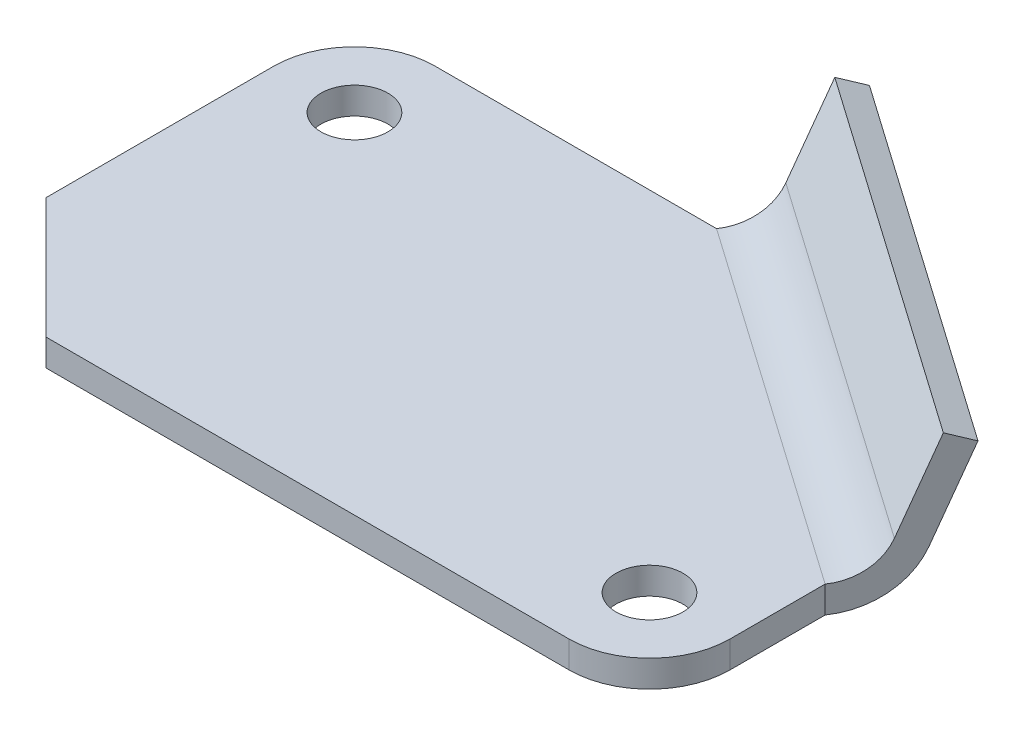
ISO-10303-21;
HEADER;
FILE_DESCRIPTION(('STEP AP214'),'2;1');
FILE_NAME('part.step','',(''),(''),'','','');
FILE_SCHEMA(('AUTOMOTIVE_DESIGN { 1 0 10303 214 1 1 1 1 }'));
ENDSEC;
DATA;
#1=APPLICATION_CONTEXT('core data for automotive mechanical design processes');
#2=APPLICATION_PROTOCOL_DEFINITION('international standard','automotive_design',2000,#1);
#3=PRODUCT_CONTEXT('',#1,'mechanical');
#4=PRODUCT('Part','Part','',(#3));
#5=PRODUCT_RELATED_PRODUCT_CATEGORY('part','',(#4));
#6=PRODUCT_DEFINITION_FORMATION('','',#4);
#7=PRODUCT_DEFINITION_CONTEXT('part definition',#1,'design');
#8=PRODUCT_DEFINITION('design','',#6,#7);
#9=PRODUCT_DEFINITION_SHAPE('','',#8);
#10=(LENGTH_UNIT() NAMED_UNIT(*) SI_UNIT(.MILLI.,.METRE.));
#11=(NAMED_UNIT(*) PLANE_ANGLE_UNIT() SI_UNIT($,.RADIAN.));
#12=(NAMED_UNIT(*) SI_UNIT($,.STERADIAN.) SOLID_ANGLE_UNIT());
#13=UNCERTAINTY_MEASURE_WITH_UNIT(LENGTH_MEASURE(1.E-05),#10,'distance_accuracy_value','');
#14=(GEOMETRIC_REPRESENTATION_CONTEXT(3) GLOBAL_UNCERTAINTY_ASSIGNED_CONTEXT((#13)) GLOBAL_UNIT_ASSIGNED_CONTEXT((#10,
#11,#12)) REPRESENTATION_CONTEXT('',''));
#15=CARTESIAN_POINT('',(0.,0.,0.));
#16=DIRECTION('',(0.,0.,1.));
#17=DIRECTION('',(1.,0.,0.));
#18=AXIS2_PLACEMENT_3D('',#15,#16,#17);
#19=CARTESIAN_POINT('',(-42.,4.,-20.));
#20=DIRECTION('',(0.,-1.,0.));
#21=DIRECTION('',(0.,0.,-1.));
#22=AXIS2_PLACEMENT_3D('',#19,#20,#21);
#23=PLANE('',#22);
#24=CARTESIAN_POINT('',(-42.,4.,-20.));
#25=DIRECTION('',(0.,1.,0.));
#26=DIRECTION('',(0.,0.,-1.));
#27=AXIS2_PLACEMENT_3D('',#24,#25,#26);
#28=CIRCLE('',#27,12.);
#29=CARTESIAN_POINT('',(-41.9999999999999,4.,-32.));
#30=VERTEX_POINT('',#29);
#31=CARTESIAN_POINT('',(-54.,4.,-19.9999999999999));
#32=VERTEX_POINT('',#31);
#33=EDGE_CURVE('E180',#30,#32,#28,.T.);
#34=ORIENTED_EDGE('',*,*,#33,.T.);
#35=DIRECTION('',(0.,0.,1.));
#36=VECTOR('',#35,1.);
#37=CARTESIAN_POINT('',(-54.,4.,14.));
#38=LINE('',#37,#36);
#39=CARTESIAN_POINT('',(-54.,4.,14.));
#40=VERTEX_POINT('',#39);
#41=EDGE_CURVE('E104',#32,#40,#38,.T.);
#42=ORIENTED_EDGE('',*,*,#41,.T.);
#43=DIRECTION('',(0.707106781186547,0.,0.707106781186548));
#44=VECTOR('',#43,1.);
#45=CARTESIAN_POINT('',(-54.,4.,14.));
#46=LINE('',#45,#44);
#47=CARTESIAN_POINT('',(-36.,4.,32.));
#48=VERTEX_POINT('',#47);
#49=EDGE_CURVE('E122',#40,#48,#46,.T.);
#50=ORIENTED_EDGE('',*,*,#49,.T.);
#51=DIRECTION('',(1.,0.,0.));
#52=VECTOR('',#51,1.);
#53=CARTESIAN_POINT('',(-36.,4.,32.));
#54=LINE('',#53,#52);
#55=CARTESIAN_POINT('',(41.9999999999999,4.,32.));
#56=VERTEX_POINT('',#55);
#57=EDGE_CURVE('E114',#48,#56,#54,.T.);
#58=ORIENTED_EDGE('',*,*,#57,.T.);
#59=CARTESIAN_POINT('',(42.,4.,20.));
#60=DIRECTION('',(0.,1.,0.));
#61=DIRECTION('',(0.,0.,1.));
#62=AXIS2_PLACEMENT_3D('',#59,#60,#61);
#63=CIRCLE('',#62,12.);
#64=CARTESIAN_POINT('',(54.,4.,19.9999999999999));
#65=VERTEX_POINT('',#64);
#66=EDGE_CURVE('E119',#56,#65,#63,.T.);
#67=ORIENTED_EDGE('',*,*,#66,.T.);
#68=DIRECTION('',(0.,0.,-1.));
#69=VECTOR('',#68,1.);
#70=CARTESIAN_POINT('',(54.,4.,19.9999999999999));
#71=LINE('',#70,#69);
#72=CARTESIAN_POINT('',(54.,4.,5.81120706332443));
#73=VERTEX_POINT('',#72);
#74=EDGE_CURVE('E143',#65,#73,#71,.T.);
#75=ORIENTED_EDGE('',*,*,#74,.T.);
#76=DIRECTION('',(-0.819152044288991,0.,-0.573576436351047));
#77=VECTOR('',#76,1.);
#78=CARTESIAN_POINT('',(0.,4.,-32.));
#79=LINE('',#78,#77);
#80=CARTESIAN_POINT('',(0.,4.,-32.));
#81=VERTEX_POINT('',#80);
#82=EDGE_CURVE('E146',#73,#81,#79,.T.);
#83=ORIENTED_EDGE('',*,*,#82,.T.);
#84=DIRECTION('',(-1.,0.,0.));
#85=VECTOR('',#84,1.);
#86=CARTESIAN_POINT('',(-41.9999999999999,4.,-32.));
#87=LINE('',#86,#85);
#88=EDGE_CURVE('E61',#81,#30,#87,.T.);
#89=ORIENTED_EDGE('',*,*,#88,.T.);
#90=EDGE_LOOP('',(#34,#42,#50,#58,#67,#75,#83,#89));
#91=FACE_BOUND('',#90,.T.);
#92=CARTESIAN_POINT('',(42.,4.,20.));
#93=DIRECTION('',(0.,1.,0.));
#94=DIRECTION('',(0.,0.,1.));
#95=AXIS2_PLACEMENT_3D('',#92,#93,#94);
#96=CIRCLE('',#95,5.);
#97=CARTESIAN_POINT('',(42.,4.,25.));
#98=VERTEX_POINT('',#97);
#99=EDGE_CURVE('E160',#98,#98,#96,.T.);
#100=ORIENTED_EDGE('',*,*,#99,.F.);
#101=EDGE_LOOP('',(#100));
#102=FACE_BOUND('',#101,.T.);
#103=CARTESIAN_POINT('',(-42.,4.,-20.));
#104=DIRECTION('',(0.,1.,0.));
#105=DIRECTION('',(0.,0.,1.));
#106=AXIS2_PLACEMENT_3D('',#103,#104,#105);
#107=CIRCLE('',#106,5.);
#108=CARTESIAN_POINT('',(-42.,4.,-15.));
#109=VERTEX_POINT('',#108);
#110=EDGE_CURVE('E297',#109,#109,#107,.T.);
#111=ORIENTED_EDGE('',*,*,#110,.F.);
#112=EDGE_LOOP('',(#111));
#113=FACE_BOUND('',#112,.T.);
#114=ADVANCED_FACE('F43',(#91,#102,#113),#23,.F.);
#115=CARTESIAN_POINT('',(-42.,0.,-20.));
#116=DIRECTION('',(0.,-1.,0.));
#117=DIRECTION('',(0.,0.,-1.));
#118=AXIS2_PLACEMENT_3D('',#115,#116,#117);
#119=PLANE('',#118);
#120=CARTESIAN_POINT('',(42.,0.,20.));
#121=DIRECTION('',(0.,1.,0.));
#122=DIRECTION('',(0.,0.,1.));
#123=AXIS2_PLACEMENT_3D('',#120,#121,#122);
#124=CIRCLE('',#123,5.);
#125=CARTESIAN_POINT('',(42.,0.,25.));
#126=VERTEX_POINT('',#125);
#127=EDGE_CURVE('E301',#126,#126,#124,.T.);
#128=ORIENTED_EDGE('',*,*,#127,.T.);
#129=EDGE_LOOP('',(#128));
#130=FACE_BOUND('',#129,.T.);
#131=CARTESIAN_POINT('',(-42.,0.,-20.));
#132=DIRECTION('',(0.,1.,0.));
#133=DIRECTION('',(0.,0.,-1.));
#134=AXIS2_PLACEMENT_3D('',#131,#132,#133);
#135=CIRCLE('',#134,12.);
#136=CARTESIAN_POINT('',(-41.9999999999999,0.,-32.));
#137=VERTEX_POINT('',#136);
#138=CARTESIAN_POINT('',(-54.,0.,-19.9999999999999));
#139=VERTEX_POINT('',#138);
#140=EDGE_CURVE('E155',#137,#139,#135,.T.);
#141=ORIENTED_EDGE('',*,*,#140,.F.);
#142=DIRECTION('',(-1.,0.,0.));
#143=VECTOR('',#142,1.);
#144=CARTESIAN_POINT('',(-41.9999999999999,0.,-32.));
#145=LINE('',#144,#143);
#146=CARTESIAN_POINT('',(0.,0.,-32.));
#147=VERTEX_POINT('',#146);
#148=EDGE_CURVE('E96',#147,#137,#145,.T.);
#149=ORIENTED_EDGE('',*,*,#148,.F.);
#150=DIRECTION('',(-0.819152044288991,0.,-0.573576436351047));
#151=VECTOR('',#150,1.);
#152=CARTESIAN_POINT('',(0.,0.,-32.));
#153=LINE('',#152,#151);
#154=CARTESIAN_POINT('',(54.,0.,5.81120706332443));
#155=VERTEX_POINT('',#154);
#156=EDGE_CURVE('E175',#155,#147,#153,.T.);
#157=ORIENTED_EDGE('',*,*,#156,.F.);
#158=DIRECTION('',(0.,0.,-1.));
#159=VECTOR('',#158,1.);
#160=CARTESIAN_POINT('',(54.,0.,19.9999999999999));
#161=LINE('',#160,#159);
#162=CARTESIAN_POINT('',(54.,0.,19.9999999999999));
#163=VERTEX_POINT('',#162);
#164=EDGE_CURVE('E171',#163,#155,#161,.T.);
#165=ORIENTED_EDGE('',*,*,#164,.F.);
#166=CARTESIAN_POINT('',(42.,0.,20.));
#167=DIRECTION('',(0.,1.,0.));
#168=DIRECTION('',(0.,0.,1.));
#169=AXIS2_PLACEMENT_3D('',#166,#167,#168);
#170=CIRCLE('',#169,12.);
#171=CARTESIAN_POINT('',(41.9999999999999,0.,32.));
#172=VERTEX_POINT('',#171);
#173=EDGE_CURVE('E168',#172,#163,#170,.T.);
#174=ORIENTED_EDGE('',*,*,#173,.F.);
#175=DIRECTION('',(1.,0.,0.));
#176=VECTOR('',#175,1.);
#177=CARTESIAN_POINT('',(-36.,0.,32.));
#178=LINE('',#177,#176);
#179=CARTESIAN_POINT('',(-36.,0.,32.));
#180=VERTEX_POINT('',#179);
#181=EDGE_CURVE('E132',#180,#172,#178,.T.);
#182=ORIENTED_EDGE('',*,*,#181,.F.);
#183=DIRECTION('',(0.707106781186547,0.,0.707106781186548));
#184=VECTOR('',#183,1.);
#185=CARTESIAN_POINT('',(-54.,0.,14.));
#186=LINE('',#185,#184);
#187=CARTESIAN_POINT('',(-54.,0.,14.));
#188=VERTEX_POINT('',#187);
#189=EDGE_CURVE('E163',#188,#180,#186,.T.);
#190=ORIENTED_EDGE('',*,*,#189,.F.);
#191=DIRECTION('',(0.,0.,1.));
#192=VECTOR('',#191,1.);
#193=CARTESIAN_POINT('',(-54.,0.,14.));
#194=LINE('',#193,#192);
#195=EDGE_CURVE('E159',#139,#188,#194,.T.);
#196=ORIENTED_EDGE('',*,*,#195,.F.);
#197=EDGE_LOOP('',(#141,#149,#157,#165,#174,#182,#190,#196));
#198=FACE_BOUND('',#197,.T.);
#199=CARTESIAN_POINT('',(-42.,0.,-20.));
#200=DIRECTION('',(0.,1.,0.));
#201=DIRECTION('',(0.,0.,1.));
#202=AXIS2_PLACEMENT_3D('',#199,#200,#201);
#203=CIRCLE('',#202,5.);
#204=CARTESIAN_POINT('',(-42.,0.,-15.));
#205=VERTEX_POINT('',#204);
#206=EDGE_CURVE('E291',#205,#205,#203,.T.);
#207=ORIENTED_EDGE('',*,*,#206,.T.);
#208=EDGE_LOOP('',(#207));
#209=FACE_BOUND('',#208,.T.);
#210=ADVANCED_FACE('F200',(#130,#198,#209),#119,.T.);
#211=CARTESIAN_POINT('',(-42.,4.,-20.));
#212=DIRECTION('',(0.,-1.,0.));
#213=DIRECTION('',(0.,0.,-1.));
#214=AXIS2_PLACEMENT_3D('',#211,#212,#213);
#215=CYLINDRICAL_SURFACE('',#214,12.);
#216=ORIENTED_EDGE('',*,*,#140,.T.);
#217=DIRECTION('',(0.,-1.,0.));
#218=VECTOR('',#217,1.);
#219=CARTESIAN_POINT('',(-54.,4.,-19.9999999999999));
#220=LINE('',#219,#218);
#221=EDGE_CURVE('E11',#32,#139,#220,.T.);
#222=ORIENTED_EDGE('',*,*,#221,.F.);
#223=ORIENTED_EDGE('',*,*,#33,.F.);
#224=DIRECTION('',(0.,-1.,0.));
#225=VECTOR('',#224,1.);
#226=CARTESIAN_POINT('',(-41.9999999999999,4.,-32.));
#227=LINE('',#226,#225);
#228=EDGE_CURVE('E154',#30,#137,#227,.T.);
#229=ORIENTED_EDGE('',*,*,#228,.T.);
#230=EDGE_LOOP('',(#216,#222,#223,#229));
#231=FACE_BOUND('',#230,.T.);
#232=ADVANCED_FACE('F45',(#231),#215,.T.);
#233=CARTESIAN_POINT('',(-54.,4.,14.));
#234=DIRECTION('',(1.,0.,0.));
#235=DIRECTION('',(0.,0.,-1.));
#236=AXIS2_PLACEMENT_3D('',#233,#234,#235);
#237=PLANE('',#236);
#238=ORIENTED_EDGE('',*,*,#195,.T.);
#239=DIRECTION('',(0.,-1.,0.));
#240=VECTOR('',#239,1.);
#241=CARTESIAN_POINT('',(-54.,4.,14.));
#242=LINE('',#241,#240);
#243=EDGE_CURVE('E53',#40,#188,#242,.T.);
#244=ORIENTED_EDGE('',*,*,#243,.F.);
#245=ORIENTED_EDGE('',*,*,#41,.F.);
#246=ORIENTED_EDGE('',*,*,#221,.T.);
#247=EDGE_LOOP('',(#238,#244,#245,#246));
#248=FACE_BOUND('',#247,.T.);
#249=ADVANCED_FACE('F318',(#248),#237,.F.);
#250=CARTESIAN_POINT('',(-54.,4.,14.));
#251=DIRECTION('',(0.707106781186548,0.,-0.707106781186547));
#252=DIRECTION('',(-0.707106781186547,0.,-0.707106781186548));
#253=AXIS2_PLACEMENT_3D('',#250,#251,#252);
#254=PLANE('',#253);
#255=ORIENTED_EDGE('',*,*,#189,.T.);
#256=DIRECTION('',(0.,-1.,0.));
#257=VECTOR('',#256,1.);
#258=CARTESIAN_POINT('',(-36.,4.,32.));
#259=LINE('',#258,#257);
#260=EDGE_CURVE('E136',#48,#180,#259,.T.);
#261=ORIENTED_EDGE('',*,*,#260,.F.);
#262=ORIENTED_EDGE('',*,*,#49,.F.);
#263=ORIENTED_EDGE('',*,*,#243,.T.);
#264=EDGE_LOOP('',(#255,#261,#262,#263));
#265=FACE_BOUND('',#264,.T.);
#266=ADVANCED_FACE('F197',(#265),#254,.F.);
#267=CARTESIAN_POINT('',(-36.,4.,32.));
#268=DIRECTION('',(0.,0.,-1.));
#269=DIRECTION('',(-1.,0.,0.));
#270=AXIS2_PLACEMENT_3D('',#267,#268,#269);
#271=PLANE('',#270);
#272=ORIENTED_EDGE('',*,*,#181,.T.);
#273=DIRECTION('',(0.,-1.,0.));
#274=VECTOR('',#273,1.);
#275=CARTESIAN_POINT('',(41.9999999999999,4.,32.));
#276=LINE('',#275,#274);
#277=EDGE_CURVE('E129',#56,#172,#276,.T.);
#278=ORIENTED_EDGE('',*,*,#277,.F.);
#279=ORIENTED_EDGE('',*,*,#57,.F.);
#280=ORIENTED_EDGE('',*,*,#260,.T.);
#281=EDGE_LOOP('',(#272,#278,#279,#280));
#282=FACE_BOUND('',#281,.T.);
#283=ADVANCED_FACE('F130',(#282),#271,.F.);
#284=CARTESIAN_POINT('',(42.,4.,20.));
#285=DIRECTION('',(0.,-1.,0.));
#286=DIRECTION('',(0.,0.,-1.));
#287=AXIS2_PLACEMENT_3D('',#284,#285,#286);
#288=CYLINDRICAL_SURFACE('',#287,12.);
#289=ORIENTED_EDGE('',*,*,#173,.T.);
#290=DIRECTION('',(0.,-1.,0.));
#291=VECTOR('',#290,1.);
#292=CARTESIAN_POINT('',(54.,4.,19.9999999999999));
#293=LINE('',#292,#291);
#294=EDGE_CURVE('E137',#65,#163,#293,.T.);
#295=ORIENTED_EDGE('',*,*,#294,.F.);
#296=ORIENTED_EDGE('',*,*,#66,.F.);
#297=ORIENTED_EDGE('',*,*,#277,.T.);
#298=EDGE_LOOP('',(#289,#295,#296,#297));
#299=FACE_BOUND('',#298,.T.);
#300=ADVANCED_FACE('F139',(#299),#288,.T.);
#301=CARTESIAN_POINT('',(54.,4.,19.9999999999999));
#302=DIRECTION('',(-1.,0.,0.));
#303=DIRECTION('',(0.,0.,1.));
#304=AXIS2_PLACEMENT_3D('',#301,#302,#303);
#305=PLANE('',#304);
#306=ORIENTED_EDGE('',*,*,#164,.T.);
#307=DIRECTION('',(0.,-1.,0.));
#308=VECTOR('',#307,1.);
#309=CARTESIAN_POINT('',(54.,4.,5.81120706332443));
#310=LINE('',#309,#308);
#311=EDGE_CURVE('E186',#73,#155,#310,.T.);
#312=ORIENTED_EDGE('',*,*,#311,.F.);
#313=ORIENTED_EDGE('',*,*,#74,.F.);
#314=ORIENTED_EDGE('',*,*,#294,.T.);
#315=EDGE_LOOP('',(#306,#312,#313,#314));
#316=FACE_BOUND('',#315,.T.);
#317=ADVANCED_FACE('F205',(#316),#305,.F.);
#318=CARTESIAN_POINT('',(-41.9999999999999,4.,-32.));
#319=DIRECTION('',(0.,0.,1.));
#320=DIRECTION('',(1.,0.,0.));
#321=AXIS2_PLACEMENT_3D('',#318,#319,#320);
#322=PLANE('',#321);
#323=ORIENTED_EDGE('',*,*,#148,.T.);
#324=ORIENTED_EDGE('',*,*,#228,.F.);
#325=ORIENTED_EDGE('',*,*,#88,.F.);
#326=DIRECTION('',(0.,-1.,0.));
#327=VECTOR('',#326,1.);
#328=CARTESIAN_POINT('',(0.,4.,-32.));
#329=LINE('',#328,#327);
#330=EDGE_CURVE('E183',#81,#147,#329,.T.);
#331=ORIENTED_EDGE('',*,*,#330,.T.);
#332=EDGE_LOOP('',(#323,#324,#325,#331));
#333=FACE_BOUND('',#332,.T.);
#334=ADVANCED_FACE('F336',(#333),#322,.F.);
#335=CARTESIAN_POINT('',(42.,4.,20.));
#336=DIRECTION('',(0.,-1.,0.));
#337=DIRECTION('',(0.,0.,-1.));
#338=AXIS2_PLACEMENT_3D('',#335,#336,#337);
#339=CYLINDRICAL_SURFACE('',#338,5.);
#340=ORIENTED_EDGE('',*,*,#99,.T.);
#341=EDGE_LOOP('',(#340));
#342=FACE_BOUND('',#341,.T.);
#343=ORIENTED_EDGE('',*,*,#127,.F.);
#344=EDGE_LOOP('',(#343));
#345=FACE_BOUND('',#344,.T.);
#346=ADVANCED_FACE('F333',(#342,#345),#339,.F.);
#347=CARTESIAN_POINT('',(-42.,4.,-20.));
#348=DIRECTION('',(0.,-1.,0.));
#349=DIRECTION('',(0.,0.,-1.));
#350=AXIS2_PLACEMENT_3D('',#347,#348,#349);
#351=CYLINDRICAL_SURFACE('',#350,5.);
#352=ORIENTED_EDGE('',*,*,#110,.T.);
#353=EDGE_LOOP('',(#352));
#354=FACE_BOUND('',#353,.T.);
#355=ORIENTED_EDGE('',*,*,#206,.F.);
#356=EDGE_LOOP('',(#355));
#357=FACE_BOUND('',#356,.T.);
#358=ADVANCED_FACE('F368',(#354,#357),#351,.F.);
#359=CARTESIAN_POINT('',(0.,12.,-32.));
#360=DIRECTION('',(0.819152044288991,0.,0.573576436351047));
#361=DIRECTION('',(0.573576436351047,0.,-0.819152044288991));
#362=AXIS2_PLACEMENT_3D('',#359,#360,#361);
#363=CYLINDRICAL_SURFACE('',#362,12.);
#364=CARTESIAN_POINT('',(54.,12.,5.81120706332443));
#365=DIRECTION('',(0.819152044288991,0.,0.573576436351047));
#366=DIRECTION('',(0.573576436351047,0.,-0.819152044288991));
#367=AXIS2_PLACEMENT_3D('',#364,#365,#366);
#368=CIRCLE('',#367,12.);
#369=CARTESIAN_POINT('',(60.3817297337358,7.50472087900908,-3.30284753547716));
#370=VERTEX_POINT('',#369);
#371=EDGE_CURVE('E276',#155,#370,#368,.T.);
#372=ORIENTED_EDGE('',*,*,#371,.F.);
#373=ORIENTED_EDGE('',*,*,#156,.T.);
#374=CARTESIAN_POINT('',(0.,12.,-32.));
#375=DIRECTION('',(0.819152044288991,0.,0.573576436351047));
#376=DIRECTION('',(0.573576436351047,0.,-0.819152044288991));
#377=AXIS2_PLACEMENT_3D('',#374,#375,#376);
#378=CIRCLE('',#377,12.);
#379=CARTESIAN_POINT('',(6.38172973373577,7.50472087900908,-41.1140545988016));
#380=VERTEX_POINT('',#379);
#381=EDGE_CURVE('E89',#147,#380,#378,.T.);
#382=ORIENTED_EDGE('',*,*,#381,.T.);
#383=DIRECTION('',(0.819152044288991,0.,0.573576436351047));
#384=VECTOR('',#383,1.);
#385=CARTESIAN_POINT('',(6.38172973373577,7.50472087900908,-41.1140545988016));
#386=LINE('',#385,#384);
#387=EDGE_CURVE('E242',#380,#370,#386,.T.);
#388=ORIENTED_EDGE('',*,*,#387,.T.);
#389=EDGE_LOOP('',(#372,#373,#382,#388));
#390=FACE_BOUND('',#389,.T.);
#391=ADVANCED_FACE('F260',(#390),#363,.T.);
#392=CARTESIAN_POINT('',(0.,12.,-32.));
#393=DIRECTION('',(0.819152044288991,0.,0.573576436351047));
#394=DIRECTION('',(0.573576436351047,0.,-0.819152044288991));
#395=AXIS2_PLACEMENT_3D('',#392,#393,#394);
#396=CYLINDRICAL_SURFACE('',#395,8.);
#397=CARTESIAN_POINT('',(54.,12.,5.81120706332443));
#398=DIRECTION('',(-0.819152044288991,0.,-0.573576436351047));
#399=DIRECTION('',(0.573576436351047,0.,-0.819152044288991));
#400=AXIS2_PLACEMENT_3D('',#397,#398,#399);
#401=CIRCLE('',#400,8.);
#402=CARTESIAN_POINT('',(58.2544864891572,9.00314725267272,-0.264829335876618));
#403=VERTEX_POINT('',#402);
#404=EDGE_CURVE('E262',#403,#73,#401,.T.);
#405=ORIENTED_EDGE('',*,*,#404,.F.);
#406=DIRECTION('',(0.819152044288991,0.,0.573576436351047));
#407=VECTOR('',#406,1.);
#408=CARTESIAN_POINT('',(4.25448648915718,9.00314725267272,-38.0760363992011));
#409=LINE('',#408,#407);
#410=CARTESIAN_POINT('',(4.25448648915718,9.00314725267272,-38.0760363992011));
#411=VERTEX_POINT('',#410);
#412=EDGE_CURVE('E288',#411,#403,#409,.T.);
#413=ORIENTED_EDGE('',*,*,#412,.F.);
#414=CARTESIAN_POINT('',(0.,12.,-32.));
#415=DIRECTION('',(-0.819152044288991,0.,-0.573576436351047));
#416=DIRECTION('',(0.573576436351047,0.,-0.819152044288991));
#417=AXIS2_PLACEMENT_3D('',#414,#415,#416);
#418=CIRCLE('',#417,8.);
#419=EDGE_CURVE('E251',#411,#81,#418,.T.);
#420=ORIENTED_EDGE('',*,*,#419,.T.);
#421=ORIENTED_EDGE('',*,*,#82,.F.);
#422=EDGE_LOOP('',(#405,#413,#420,#421));
#423=FACE_BOUND('',#422,.T.);
#424=ADVANCED_FACE('F380',(#423),#396,.F.);
#425=CARTESIAN_POINT('',(4.25448648915718,9.00314725267272,-38.0760363992011));
#426=DIRECTION('',(-0.531810811144646,0.37460659341591,0.759504549900131));
#427=DIRECTION('',(0.819152044288991,0.,0.573576436351047));
#428=AXIS2_PLACEMENT_3D('',#425,#426,#427);
#429=PLANE('',#428);
#430=DIRECTION('',(-0.214865514885103,-0.927183854566788,0.306859756800777));
#431=VECTOR('',#430,1.);
#432=CARTESIAN_POINT('',(58.2544864891572,9.00314725267272,-0.264829335876619));
#433=LINE('',#432,#431);
#434=CARTESIAN_POINT('',(61.2626036975486,21.9837212166078,-4.5608659310875));
#435=VERTEX_POINT('',#434);
#436=EDGE_CURVE('E265',#435,#403,#433,.T.);
#437=ORIENTED_EDGE('',*,*,#436,.F.);
#438=DIRECTION('',(0.819152044288991,0.,0.573576436351047));
#439=VECTOR('',#438,1.);
#440=CARTESIAN_POINT('',(7.26260369754862,21.9837212166078,-42.3720729944119));
#441=LINE('',#440,#439);
#442=CARTESIAN_POINT('',(7.26260369754862,21.9837212166078,-42.3720729944119));
#443=VERTEX_POINT('',#442);
#444=EDGE_CURVE('E292',#443,#435,#441,.T.);
#445=ORIENTED_EDGE('',*,*,#444,.F.);
#446=DIRECTION('',(-0.214865514885103,-0.927183854566788,0.306859756800777));
#447=VECTOR('',#446,1.);
#448=CARTESIAN_POINT('',(4.25448648915718,9.00314725267272,-38.0760363992011));
#449=LINE('',#448,#447);
#450=EDGE_CURVE('E270',#443,#411,#449,.T.);
#451=ORIENTED_EDGE('',*,*,#450,.T.);
#452=ORIENTED_EDGE('',*,*,#412,.T.);
#453=EDGE_LOOP('',(#437,#445,#451,#452));
#454=FACE_BOUND('',#453,.T.);
#455=ADVANCED_FACE('F387',(#454),#429,.T.);
#456=CARTESIAN_POINT('',(9.3898469421272,20.4852948429441,-45.4100911940125));
#457=DIRECTION('',(0.214865514885103,0.927183854566788,-0.306859756800777));
#458=DIRECTION('',(0.,0.314198283252712,0.949357382022728));
#459=AXIS2_PLACEMENT_3D('',#456,#457,#458);
#460=PLANE('',#459);
#461=DIRECTION('',(-0.531810811144645,0.37460659341591,0.759504549900132));
#462=VECTOR('',#461,1.);
#463=CARTESIAN_POINT('',(63.3898469421272,20.4852948429441,-7.59888413068803));
#464=LINE('',#463,#462);
#465=CARTESIAN_POINT('',(63.3898469421272,20.4852948429441,-7.59888413068803));
#466=VERTEX_POINT('',#465);
#467=EDGE_CURVE('E281',#466,#435,#464,.T.);
#468=ORIENTED_EDGE('',*,*,#467,.F.);
#469=DIRECTION('',(0.819152044288991,0.,0.573576436351047));
#470=VECTOR('',#469,1.);
#471=CARTESIAN_POINT('',(9.3898469421272,20.4852948429441,-45.4100911940125));
#472=LINE('',#471,#470);
#473=CARTESIAN_POINT('',(9.3898469421272,20.4852948429441,-45.4100911940125));
#474=VERTEX_POINT('',#473);
#475=EDGE_CURVE('E250',#474,#466,#472,.T.);
#476=ORIENTED_EDGE('',*,*,#475,.F.);
#477=DIRECTION('',(-0.531810811144645,0.37460659341591,0.759504549900132));
#478=VECTOR('',#477,1.);
#479=CARTESIAN_POINT('',(9.3898469421272,20.4852948429441,-45.4100911940125));
#480=LINE('',#479,#478);
#481=EDGE_CURVE('E257',#474,#443,#480,.T.);
#482=ORIENTED_EDGE('',*,*,#481,.T.);
#483=ORIENTED_EDGE('',*,*,#444,.T.);
#484=EDGE_LOOP('',(#468,#476,#482,#483));
#485=FACE_BOUND('',#484,.T.);
#486=ADVANCED_FACE('F394',(#485),#460,.T.);
#487=CARTESIAN_POINT('',(6.38172973373577,7.50472087900908,-41.1140545988016));
#488=DIRECTION('',(0.531810811144646,-0.374606593415909,-0.759504549900132));
#489=DIRECTION('',(-0.819152044288991,0.,-0.573576436351047));
#490=AXIS2_PLACEMENT_3D('',#487,#488,#489);
#491=PLANE('',#490);
#492=DIRECTION('',(0.214865514885102,0.927183854566789,-0.306859756800776));
#493=VECTOR('',#492,1.);
#494=CARTESIAN_POINT('',(60.3817297337358,7.50472087900908,-3.30284753547716));
#495=LINE('',#494,#493);
#496=EDGE_CURVE('E246',#370,#466,#495,.T.);
#497=ORIENTED_EDGE('',*,*,#496,.F.);
#498=ORIENTED_EDGE('',*,*,#387,.F.);
#499=DIRECTION('',(0.214865514885102,0.927183854566789,-0.306859756800776));
#500=VECTOR('',#499,1.);
#501=CARTESIAN_POINT('',(6.38172973373577,7.50472087900908,-41.1140545988016));
#502=LINE('',#501,#500);
#503=EDGE_CURVE('E244',#380,#474,#502,.T.);
#504=ORIENTED_EDGE('',*,*,#503,.T.);
#505=ORIENTED_EDGE('',*,*,#475,.T.);
#506=EDGE_LOOP('',(#497,#498,#504,#505));
#507=FACE_BOUND('',#506,.T.);
#508=ADVANCED_FACE('F243',(#507),#491,.T.);
#509=CARTESIAN_POINT('',(0.,12.,-32.));
#510=DIRECTION('',(0.819152044288991,0.,0.573576436351047));
#511=DIRECTION('',(0.573576436351047,0.,-0.819152044288991));
#512=AXIS2_PLACEMENT_3D('',#509,#510,#511);
#513=PLANE('',#512);
#514=ORIENTED_EDGE('',*,*,#381,.F.);
#515=ORIENTED_EDGE('',*,*,#330,.F.);
#516=ORIENTED_EDGE('',*,*,#419,.F.);
#517=ORIENTED_EDGE('',*,*,#450,.F.);
#518=ORIENTED_EDGE('',*,*,#481,.F.);
#519=ORIENTED_EDGE('',*,*,#503,.F.);
#520=EDGE_LOOP('',(#514,#515,#516,#517,#518,#519));
#521=FACE_BOUND('',#520,.T.);
#522=ADVANCED_FACE('F254',(#521),#513,.F.);
#523=CARTESIAN_POINT('',(54.,12.,5.81120706332443));
#524=DIRECTION('',(0.819152044288991,0.,0.573576436351047));
#525=DIRECTION('',(0.573576436351047,0.,-0.819152044288991));
#526=AXIS2_PLACEMENT_3D('',#523,#524,#525);
#527=PLANE('',#526);
#528=ORIENTED_EDGE('',*,*,#371,.T.);
#529=ORIENTED_EDGE('',*,*,#496,.T.);
#530=ORIENTED_EDGE('',*,*,#467,.T.);
#531=ORIENTED_EDGE('',*,*,#436,.T.);
#532=ORIENTED_EDGE('',*,*,#404,.T.);
#533=ORIENTED_EDGE('',*,*,#311,.T.);
#534=EDGE_LOOP('',(#528,#529,#530,#531,#532,#533));
#535=FACE_BOUND('',#534,.T.);
#536=ADVANCED_FACE('F415',(#535),#527,.T.);
#537=CLOSED_SHELL('',(#114,#210,#232,#249,#266,#283,#300,#317,#334,#346,#358,#391,#424,#455,
#486,#508,#522,#536));
#538=MANIFOLD_SOLID_BREP('B2',#537);
#539=ADVANCED_BREP_SHAPE_REPRESENTATION('',(#18,#538),#14);
#540=SHAPE_DEFINITION_REPRESENTATION(#9,#539);
ENDSEC;
END-ISO-10303-21;
